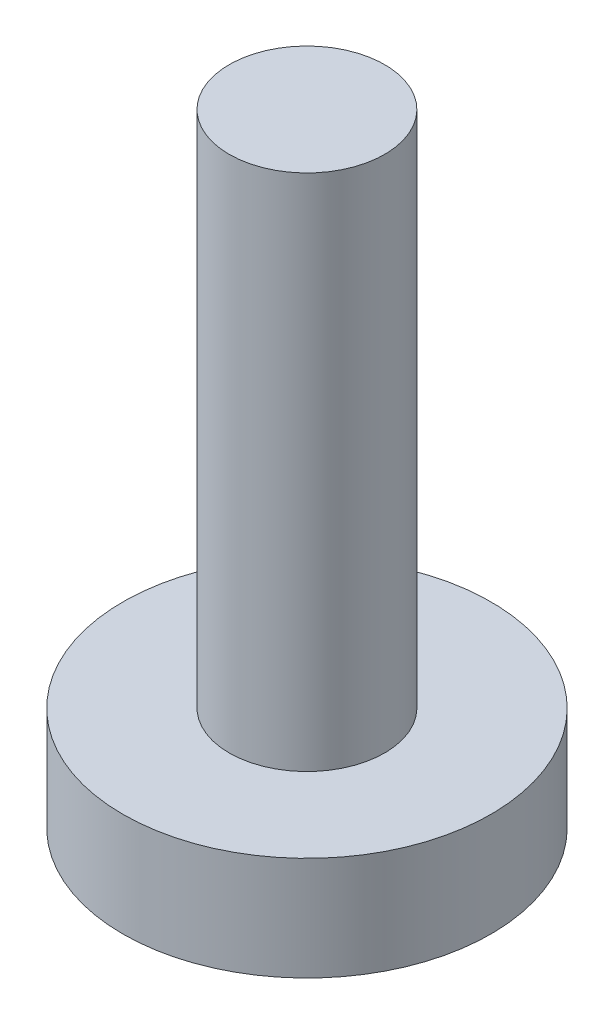
ISO-10303-21;
HEADER;
FILE_DESCRIPTION(('STEP AP214'),'2;1');
FILE_NAME('part.step','',(''),(''),'','','');
FILE_SCHEMA(('AUTOMOTIVE_DESIGN { 1 0 10303 214 1 1 1 1 }'));
ENDSEC;
DATA;
#1=APPLICATION_CONTEXT('core data for automotive mechanical design processes');
#2=APPLICATION_PROTOCOL_DEFINITION('international standard','automotive_design',2000,#1);
#3=PRODUCT_CONTEXT('',#1,'mechanical');
#4=PRODUCT('Part','Part','',(#3));
#5=PRODUCT_RELATED_PRODUCT_CATEGORY('part','',(#4));
#6=PRODUCT_DEFINITION_FORMATION('','',#4);
#7=PRODUCT_DEFINITION_CONTEXT('part definition',#1,'design');
#8=PRODUCT_DEFINITION('design','',#6,#7);
#9=PRODUCT_DEFINITION_SHAPE('','',#8);
#10=(LENGTH_UNIT() NAMED_UNIT(*) SI_UNIT(.MILLI.,.METRE.));
#11=(NAMED_UNIT(*) PLANE_ANGLE_UNIT() SI_UNIT($,.RADIAN.));
#12=(NAMED_UNIT(*) SI_UNIT($,.STERADIAN.) SOLID_ANGLE_UNIT());
#13=UNCERTAINTY_MEASURE_WITH_UNIT(LENGTH_MEASURE(1.E-05),#10,'distance_accuracy_value','');
#14=(GEOMETRIC_REPRESENTATION_CONTEXT(3) GLOBAL_UNCERTAINTY_ASSIGNED_CONTEXT((#13)) GLOBAL_UNIT_ASSIGNED_CONTEXT((#10,
#11,#12)) REPRESENTATION_CONTEXT('',''));
#15=CARTESIAN_POINT('',(0.,0.,0.));
#16=DIRECTION('',(0.,0.,1.));
#17=DIRECTION('',(1.,0.,0.));
#18=AXIS2_PLACEMENT_3D('',#15,#16,#17);
#19=CARTESIAN_POINT('',(0.,2.,0.));
#20=DIRECTION('',(0.,-1.,0.));
#21=DIRECTION('',(0.,0.,-1.));
#22=AXIS2_PLACEMENT_3D('',#19,#20,#21);
#23=CYLINDRICAL_SURFACE('',#22,3.55);
#24=CARTESIAN_POINT('',(0.,2.,0.));
#25=DIRECTION('',(0.,1.,0.));
#26=DIRECTION('',(0.,0.,1.));
#27=AXIS2_PLACEMENT_3D('',#24,#25,#26);
#28=CIRCLE('',#27,3.55);
#29=CARTESIAN_POINT('',(0.,2.,3.55));
#30=VERTEX_POINT('',#29);
#31=EDGE_CURVE('E10',#30,#30,#28,.T.);
#32=ORIENTED_EDGE('',*,*,#31,.F.);
#33=EDGE_LOOP('',(#32));
#34=FACE_BOUND('',#33,.T.);
#35=CARTESIAN_POINT('',(0.,0.,0.));
#36=DIRECTION('',(0.,1.,0.));
#37=DIRECTION('',(0.,0.,1.));
#38=AXIS2_PLACEMENT_3D('',#35,#36,#37);
#39=CIRCLE('',#38,3.55);
#40=CARTESIAN_POINT('',(0.,0.,3.55));
#41=VERTEX_POINT('',#40);
#42=EDGE_CURVE('E38',#41,#41,#39,.T.);
#43=ORIENTED_EDGE('',*,*,#42,.T.);
#44=EDGE_LOOP('',(#43));
#45=FACE_BOUND('',#44,.T.);
#46=ADVANCED_FACE('F35',(#34,#45),#23,.T.);
#47=CARTESIAN_POINT('',(0.,2.,0.));
#48=DIRECTION('',(0.,1.,0.));
#49=DIRECTION('',(0.,0.,1.));
#50=AXIS2_PLACEMENT_3D('',#47,#48,#49);
#51=PLANE('',#50);
#52=CARTESIAN_POINT('',(0.,2.,0.));
#53=DIRECTION('',(0.,1.,0.));
#54=DIRECTION('',(0.,0.,1.));
#55=AXIS2_PLACEMENT_3D('',#52,#53,#54);
#56=CIRCLE('',#55,1.5);
#57=CARTESIAN_POINT('',(0.,2.,1.5));
#58=VERTEX_POINT('',#57);
#59=EDGE_CURVE('E47',#58,#58,#56,.T.);
#60=ORIENTED_EDGE('',*,*,#59,.F.);
#61=EDGE_LOOP('',(#60));
#62=FACE_BOUND('',#61,.T.);
#63=ORIENTED_EDGE('',*,*,#31,.T.);
#64=EDGE_LOOP('',(#63));
#65=FACE_BOUND('',#64,.T.);
#66=ADVANCED_FACE('F62',(#62,#65),#51,.T.);
#67=CARTESIAN_POINT('',(0.,0.,0.));
#68=DIRECTION('',(0.,1.,0.));
#69=DIRECTION('',(0.,0.,1.));
#70=AXIS2_PLACEMENT_3D('',#67,#68,#69);
#71=PLANE('',#70);
#72=ORIENTED_EDGE('',*,*,#42,.F.);
#73=EDGE_LOOP('',(#72));
#74=FACE_BOUND('',#73,.T.);
#75=ADVANCED_FACE('F58',(#74),#71,.F.);
#76=CARTESIAN_POINT('',(0.,12.,0.));
#77=DIRECTION('',(0.,-1.,0.));
#78=DIRECTION('',(0.,0.,-1.));
#79=AXIS2_PLACEMENT_3D('',#76,#77,#78);
#80=CYLINDRICAL_SURFACE('',#79,1.5);
#81=CARTESIAN_POINT('',(0.,12.,0.));
#82=DIRECTION('',(0.,1.,0.));
#83=DIRECTION('',(0.,0.,1.));
#84=AXIS2_PLACEMENT_3D('',#81,#82,#83);
#85=CIRCLE('',#84,1.5);
#86=CARTESIAN_POINT('',(0.,12.,1.5));
#87=VERTEX_POINT('',#86);
#88=EDGE_CURVE('E45',#87,#87,#85,.T.);
#89=ORIENTED_EDGE('',*,*,#88,.F.);
#90=EDGE_LOOP('',(#89));
#91=FACE_BOUND('',#90,.T.);
#92=ORIENTED_EDGE('',*,*,#59,.T.);
#93=EDGE_LOOP('',(#92));
#94=FACE_BOUND('',#93,.T.);
#95=ADVANCED_FACE('F55',(#91,#94),#80,.T.);
#96=CARTESIAN_POINT('',(0.,12.,0.));
#97=DIRECTION('',(0.,1.,0.));
#98=DIRECTION('',(0.,0.,1.));
#99=AXIS2_PLACEMENT_3D('',#96,#97,#98);
#100=PLANE('',#99);
#101=ORIENTED_EDGE('',*,*,#88,.T.);
#102=EDGE_LOOP('',(#101));
#103=FACE_BOUND('',#102,.T.);
#104=ADVANCED_FACE('F53',(#103),#100,.T.);
#105=CLOSED_SHELL('',(#46,#66,#75,#95,#104));
#106=MANIFOLD_SOLID_BREP('B2',#105);
#107=ADVANCED_BREP_SHAPE_REPRESENTATION('',(#18,#106),#14);
#108=SHAPE_DEFINITION_REPRESENTATION(#9,#107);
ENDSEC;
END-ISO-10303-21;
